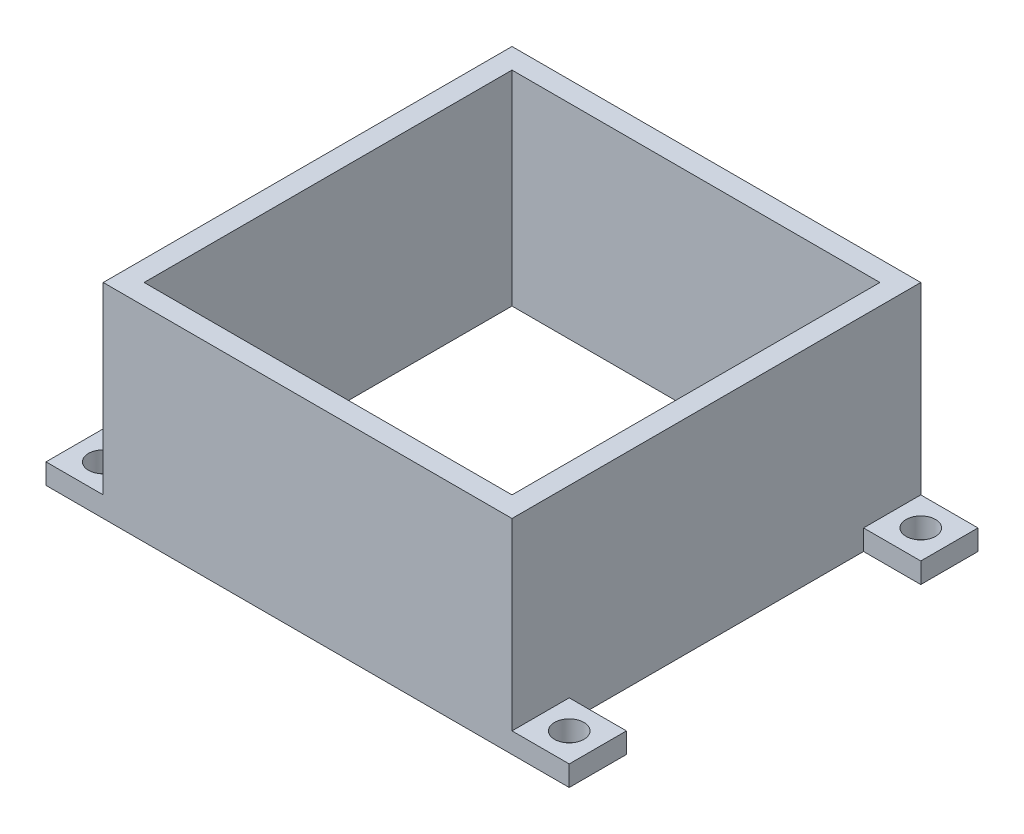
ISO-10303-21;
HEADER;
FILE_DESCRIPTION(('STEP AP214'),'2;1');
FILE_NAME('part.step','',(''),(''),'','','');
FILE_SCHEMA(('AUTOMOTIVE_DESIGN { 1 0 10303 214 1 1 1 1 }'));
ENDSEC;
DATA;
#1=APPLICATION_CONTEXT('core data for automotive mechanical design processes');
#2=APPLICATION_PROTOCOL_DEFINITION('international standard','automotive_design',2000,#1);
#3=PRODUCT_CONTEXT('',#1,'mechanical');
#4=PRODUCT('Part','Part','',(#3));
#5=PRODUCT_RELATED_PRODUCT_CATEGORY('part','',(#4));
#6=PRODUCT_DEFINITION_FORMATION('','',#4);
#7=PRODUCT_DEFINITION_CONTEXT('part definition',#1,'design');
#8=PRODUCT_DEFINITION('design','',#6,#7);
#9=PRODUCT_DEFINITION_SHAPE('','',#8);
#10=(LENGTH_UNIT() NAMED_UNIT(*) SI_UNIT(.MILLI.,.METRE.));
#11=(NAMED_UNIT(*) PLANE_ANGLE_UNIT() SI_UNIT($,.RADIAN.));
#12=(NAMED_UNIT(*) SI_UNIT($,.STERADIAN.) SOLID_ANGLE_UNIT());
#13=UNCERTAINTY_MEASURE_WITH_UNIT(LENGTH_MEASURE(1.E-05),#10,'distance_accuracy_value','');
#14=(GEOMETRIC_REPRESENTATION_CONTEXT(3) GLOBAL_UNCERTAINTY_ASSIGNED_CONTEXT((#13)) GLOBAL_UNIT_ASSIGNED_CONTEXT((#10,
#11,#12)) REPRESENTATION_CONTEXT('',''));
#15=CARTESIAN_POINT('',(0.,0.,0.));
#16=DIRECTION('',(0.,0.,1.));
#17=DIRECTION('',(1.,0.,0.));
#18=AXIS2_PLACEMENT_3D('',#15,#16,#17);
#19=CARTESIAN_POINT('',(25.,25.,-25.));
#20=DIRECTION('',(-1.,0.,0.));
#21=DIRECTION('',(0.,0.,1.));
#22=AXIS2_PLACEMENT_3D('',#19,#20,#21);
#23=PLANE('',#22);
#24=DIRECTION('',(0.,0.,-1.));
#25=VECTOR('',#24,1.);
#26=CARTESIAN_POINT('',(25.,0.,-25.));
#27=LINE('',#26,#25);
#28=CARTESIAN_POINT('',(25.,0.,18.));
#29=VERTEX_POINT('',#28);
#30=CARTESIAN_POINT('',(25.,0.,-18.));
#31=VERTEX_POINT('',#30);
#32=EDGE_CURVE('E215',#29,#31,#27,.T.);
#33=ORIENTED_EDGE('',*,*,#32,.T.);
#34=DIRECTION('',(0.,-1.,0.));
#35=VECTOR('',#34,1.);
#36=CARTESIAN_POINT('',(25.,2.5,-18.));
#37=LINE('',#36,#35);
#38=CARTESIAN_POINT('',(25.,2.5,-18.));
#39=VERTEX_POINT('',#38);
#40=EDGE_CURVE('E196',#39,#31,#37,.T.);
#41=ORIENTED_EDGE('',*,*,#40,.F.);
#42=DIRECTION('',(0.,0.,-1.));
#43=VECTOR('',#42,1.);
#44=CARTESIAN_POINT('',(25.,2.5,-25.));
#45=LINE('',#44,#43);
#46=CARTESIAN_POINT('',(25.,2.5,-25.));
#47=VERTEX_POINT('',#46);
#48=EDGE_CURVE('E180',#39,#47,#45,.T.);
#49=ORIENTED_EDGE('',*,*,#48,.T.);
#50=DIRECTION('',(0.,-1.,0.));
#51=VECTOR('',#50,1.);
#52=CARTESIAN_POINT('',(25.,25.,-25.));
#53=LINE('',#52,#51);
#54=CARTESIAN_POINT('',(25.,25.,-25.));
#55=VERTEX_POINT('',#54);
#56=EDGE_CURVE('E194',#55,#47,#53,.T.);
#57=ORIENTED_EDGE('',*,*,#56,.F.);
#58=DIRECTION('',(0.,0.,-1.));
#59=VECTOR('',#58,1.);
#60=CARTESIAN_POINT('',(25.,25.,-25.));
#61=LINE('',#60,#59);
#62=CARTESIAN_POINT('',(25.,25.,25.));
#63=VERTEX_POINT('',#62);
#64=EDGE_CURVE('E227',#63,#55,#61,.T.);
#65=ORIENTED_EDGE('',*,*,#64,.F.);
#66=DIRECTION('',(0.,-1.,0.));
#67=VECTOR('',#66,1.);
#68=CARTESIAN_POINT('',(25.,25.,25.));
#69=LINE('',#68,#67);
#70=CARTESIAN_POINT('',(25.,2.5,25.));
#71=VERTEX_POINT('',#70);
#72=EDGE_CURVE('E48',#63,#71,#69,.T.);
#73=ORIENTED_EDGE('',*,*,#72,.T.);
#74=DIRECTION('',(0.,0.,1.));
#75=VECTOR('',#74,1.);
#76=CARTESIAN_POINT('',(25.,2.5,25.));
#77=LINE('',#76,#75);
#78=CARTESIAN_POINT('',(25.,2.5,18.));
#79=VERTEX_POINT('',#78);
#80=EDGE_CURVE('E337',#79,#71,#77,.T.);
#81=ORIENTED_EDGE('',*,*,#80,.F.);
#82=DIRECTION('',(0.,-1.,0.));
#83=VECTOR('',#82,1.);
#84=CARTESIAN_POINT('',(25.,2.5,18.));
#85=LINE('',#84,#83);
#86=EDGE_CURVE('E322',#79,#29,#85,.T.);
#87=ORIENTED_EDGE('',*,*,#86,.T.);
#88=EDGE_LOOP('',(#33,#41,#49,#57,#65,#73,#81,#87));
#89=FACE_BOUND('',#88,.T.);
#90=ADVANCED_FACE('F39',(#89),#23,.F.);
#91=CARTESIAN_POINT('',(-25.,25.,-25.));
#92=DIRECTION('',(1.,0.,0.));
#93=DIRECTION('',(0.,0.,-1.));
#94=AXIS2_PLACEMENT_3D('',#91,#92,#93);
#95=PLANE('',#94);
#96=DIRECTION('',(0.,-1.,0.));
#97=VECTOR('',#96,1.);
#98=CARTESIAN_POINT('',(-25.,25.,-25.));
#99=LINE('',#98,#97);
#100=CARTESIAN_POINT('',(-25.,25.,-25.));
#101=VERTEX_POINT('',#100);
#102=CARTESIAN_POINT('',(-25.,2.5,-25.));
#103=VERTEX_POINT('',#102);
#104=EDGE_CURVE('E204',#101,#103,#99,.T.);
#105=ORIENTED_EDGE('',*,*,#104,.T.);
#106=DIRECTION('',(0.,0.,-1.));
#107=VECTOR('',#106,1.);
#108=CARTESIAN_POINT('',(-25.,2.5,-25.));
#109=LINE('',#108,#107);
#110=CARTESIAN_POINT('',(-25.,2.5,-18.));
#111=VERTEX_POINT('',#110);
#112=EDGE_CURVE('E55',#111,#103,#109,.T.);
#113=ORIENTED_EDGE('',*,*,#112,.F.);
#114=DIRECTION('',(0.,-1.,0.));
#115=VECTOR('',#114,1.);
#116=CARTESIAN_POINT('',(-25.,2.5,-18.));
#117=LINE('',#116,#115);
#118=CARTESIAN_POINT('',(-25.,0.,-18.));
#119=VERTEX_POINT('',#118);
#120=EDGE_CURVE('E60',#111,#119,#117,.T.);
#121=ORIENTED_EDGE('',*,*,#120,.T.);
#122=DIRECTION('',(0.,0.,1.));
#123=VECTOR('',#122,1.);
#124=CARTESIAN_POINT('',(-25.,0.,-25.));
#125=LINE('',#124,#123);
#126=CARTESIAN_POINT('',(-25.,0.,18.));
#127=VERTEX_POINT('',#126);
#128=EDGE_CURVE('E221',#119,#127,#125,.T.);
#129=ORIENTED_EDGE('',*,*,#128,.T.);
#130=DIRECTION('',(0.,-1.,0.));
#131=VECTOR('',#130,1.);
#132=CARTESIAN_POINT('',(-25.,2.5,18.));
#133=LINE('',#132,#131);
#134=CARTESIAN_POINT('',(-25.,2.5,18.));
#135=VERTEX_POINT('',#134);
#136=EDGE_CURVE('E267',#135,#127,#133,.T.);
#137=ORIENTED_EDGE('',*,*,#136,.F.);
#138=DIRECTION('',(0.,0.,1.));
#139=VECTOR('',#138,1.);
#140=CARTESIAN_POINT('',(-25.,2.5,25.));
#141=LINE('',#140,#139);
#142=CARTESIAN_POINT('',(-25.,2.5,25.));
#143=VERTEX_POINT('',#142);
#144=EDGE_CURVE('E294',#135,#143,#141,.T.);
#145=ORIENTED_EDGE('',*,*,#144,.T.);
#146=DIRECTION('',(0.,-1.,0.));
#147=VECTOR('',#146,1.);
#148=CARTESIAN_POINT('',(-25.,25.,25.));
#149=LINE('',#148,#147);
#150=CARTESIAN_POINT('',(-25.,25.,25.));
#151=VERTEX_POINT('',#150);
#152=EDGE_CURVE('E11',#151,#143,#149,.T.);
#153=ORIENTED_EDGE('',*,*,#152,.F.);
#154=DIRECTION('',(0.,0.,1.));
#155=VECTOR('',#154,1.);
#156=CARTESIAN_POINT('',(-25.,25.,-25.));
#157=LINE('',#156,#155);
#158=EDGE_CURVE('E214',#101,#151,#157,.T.);
#159=ORIENTED_EDGE('',*,*,#158,.F.);
#160=EDGE_LOOP('',(#105,#113,#121,#129,#137,#145,#153,#159));
#161=FACE_BOUND('',#160,.T.);
#162=ADVANCED_FACE('F41',(#161),#95,.F.);
#163=CARTESIAN_POINT('',(0.,25.,0.));
#164=DIRECTION('',(0.,1.,0.));
#165=DIRECTION('',(0.,0.,1.));
#166=AXIS2_PLACEMENT_3D('',#163,#164,#165);
#167=PLANE('',#166);
#168=ORIENTED_EDGE('',*,*,#158,.T.);
#169=DIRECTION('',(1.,0.,0.));
#170=VECTOR('',#169,1.);
#171=CARTESIAN_POINT('',(-25.,25.,25.));
#172=LINE('',#171,#170);
#173=EDGE_CURVE('E230',#151,#63,#172,.T.);
#174=ORIENTED_EDGE('',*,*,#173,.T.);
#175=ORIENTED_EDGE('',*,*,#64,.T.);
#176=DIRECTION('',(-1.,0.,0.));
#177=VECTOR('',#176,1.);
#178=CARTESIAN_POINT('',(-25.,25.,-25.));
#179=LINE('',#178,#177);
#180=EDGE_CURVE('E202',#55,#101,#179,.T.);
#181=ORIENTED_EDGE('',*,*,#180,.T.);
#182=EDGE_LOOP('',(#168,#174,#175,#181));
#183=FACE_BOUND('',#182,.T.);
#184=DIRECTION('',(1.,0.,0.));
#185=VECTOR('',#184,1.);
#186=CARTESIAN_POINT('',(-22.5,25.,22.5));
#187=LINE('',#186,#185);
#188=CARTESIAN_POINT('',(-22.5,25.,22.5));
#189=VERTEX_POINT('',#188);
#190=CARTESIAN_POINT('',(22.5,25.,22.5));
#191=VERTEX_POINT('',#190);
#192=EDGE_CURVE('E274',#189,#191,#187,.T.);
#193=ORIENTED_EDGE('',*,*,#192,.F.);
#194=DIRECTION('',(0.,0.,1.));
#195=VECTOR('',#194,1.);
#196=CARTESIAN_POINT('',(-22.5,25.,-22.5));
#197=LINE('',#196,#195);
#198=CARTESIAN_POINT('',(-22.5,25.,-22.5));
#199=VERTEX_POINT('',#198);
#200=EDGE_CURVE('E254',#199,#189,#197,.T.);
#201=ORIENTED_EDGE('',*,*,#200,.F.);
#202=DIRECTION('',(-1.,0.,0.));
#203=VECTOR('',#202,1.);
#204=CARTESIAN_POINT('',(-22.5,25.,-22.5));
#205=LINE('',#204,#203);
#206=CARTESIAN_POINT('',(22.5,25.,-22.5));
#207=VERTEX_POINT('',#206);
#208=EDGE_CURVE('E249',#207,#199,#205,.T.);
#209=ORIENTED_EDGE('',*,*,#208,.F.);
#210=DIRECTION('',(0.,0.,-1.));
#211=VECTOR('',#210,1.);
#212=CARTESIAN_POINT('',(22.5,25.,-22.5));
#213=LINE('',#212,#211);
#214=EDGE_CURVE('E270',#191,#207,#213,.T.);
#215=ORIENTED_EDGE('',*,*,#214,.F.);
#216=EDGE_LOOP('',(#193,#201,#209,#215));
#217=FACE_BOUND('',#216,.T.);
#218=ADVANCED_FACE('F435',(#183,#217),#167,.T.);
#219=CARTESIAN_POINT('',(0.,0.,0.));
#220=DIRECTION('',(0.,1.,0.));
#221=DIRECTION('',(0.,0.,1.));
#222=AXIS2_PLACEMENT_3D('',#219,#220,#221);
#223=PLANE('',#222);
#224=ORIENTED_EDGE('',*,*,#128,.F.);
#225=DIRECTION('',(1.,0.,0.));
#226=VECTOR('',#225,1.);
#227=CARTESIAN_POINT('',(-25.,0.,-18.));
#228=LINE('',#227,#226);
#229=CARTESIAN_POINT('',(-32.,0.,-18.));
#230=VERTEX_POINT('',#229);
#231=EDGE_CURVE('E374',#230,#119,#228,.T.);
#232=ORIENTED_EDGE('',*,*,#231,.F.);
#233=DIRECTION('',(0.,0.,1.));
#234=VECTOR('',#233,1.);
#235=CARTESIAN_POINT('',(-32.,0.,-25.));
#236=LINE('',#235,#234);
#237=CARTESIAN_POINT('',(-32.,0.,-25.));
#238=VERTEX_POINT('',#237);
#239=EDGE_CURVE('E371',#238,#230,#236,.T.);
#240=ORIENTED_EDGE('',*,*,#239,.F.);
#241=DIRECTION('',(-1.,0.,0.));
#242=VECTOR('',#241,1.);
#243=CARTESIAN_POINT('',(-25.,0.,-25.));
#244=LINE('',#243,#242);
#245=CARTESIAN_POINT('',(32.,0.,-25.));
#246=VERTEX_POINT('',#245);
#247=EDGE_CURVE('E211',#246,#238,#244,.T.);
#248=ORIENTED_EDGE('',*,*,#247,.F.);
#249=DIRECTION('',(0.,0.,1.));
#250=VECTOR('',#249,1.);
#251=CARTESIAN_POINT('',(32.,0.,-25.));
#252=LINE('',#251,#250);
#253=CARTESIAN_POINT('',(32.,0.,-18.));
#254=VERTEX_POINT('',#253);
#255=EDGE_CURVE('E408',#246,#254,#252,.T.);
#256=ORIENTED_EDGE('',*,*,#255,.T.);
#257=DIRECTION('',(-1.,0.,0.));
#258=VECTOR('',#257,1.);
#259=CARTESIAN_POINT('',(25.,0.,-18.));
#260=LINE('',#259,#258);
#261=EDGE_CURVE('E198',#254,#31,#260,.T.);
#262=ORIENTED_EDGE('',*,*,#261,.T.);
#263=ORIENTED_EDGE('',*,*,#32,.F.);
#264=DIRECTION('',(-1.,0.,0.));
#265=VECTOR('',#264,1.);
#266=CARTESIAN_POINT('',(25.,0.,18.));
#267=LINE('',#266,#265);
#268=CARTESIAN_POINT('',(32.,0.,18.));
#269=VERTEX_POINT('',#268);
#270=EDGE_CURVE('E338',#269,#29,#267,.T.);
#271=ORIENTED_EDGE('',*,*,#270,.F.);
#272=DIRECTION('',(0.,0.,-1.));
#273=VECTOR('',#272,1.);
#274=CARTESIAN_POINT('',(32.,0.,25.));
#275=LINE('',#274,#273);
#276=CARTESIAN_POINT('',(32.,0.,25.));
#277=VERTEX_POINT('',#276);
#278=EDGE_CURVE('E334',#277,#269,#275,.T.);
#279=ORIENTED_EDGE('',*,*,#278,.F.);
#280=DIRECTION('',(1.,0.,0.));
#281=VECTOR('',#280,1.);
#282=CARTESIAN_POINT('',(-25.,0.,25.));
#283=LINE('',#282,#281);
#284=CARTESIAN_POINT('',(-32.,0.,25.));
#285=VERTEX_POINT('',#284);
#286=EDGE_CURVE('E218',#285,#277,#283,.T.);
#287=ORIENTED_EDGE('',*,*,#286,.F.);
#288=DIRECTION('',(0.,0.,-1.));
#289=VECTOR('',#288,1.);
#290=CARTESIAN_POINT('',(-32.,0.,25.));
#291=LINE('',#290,#289);
#292=CARTESIAN_POINT('',(-32.,0.,18.));
#293=VERTEX_POINT('',#292);
#294=EDGE_CURVE('E295',#285,#293,#291,.T.);
#295=ORIENTED_EDGE('',*,*,#294,.T.);
#296=DIRECTION('',(1.,0.,0.));
#297=VECTOR('',#296,1.);
#298=CARTESIAN_POINT('',(-25.,0.,18.));
#299=LINE('',#298,#297);
#300=EDGE_CURVE('E290',#293,#127,#299,.T.);
#301=ORIENTED_EDGE('',*,*,#300,.T.);
#302=EDGE_LOOP('',(#224,#232,#240,#248,#256,#262,#263,#271,#279,#287,#295,#301));
#303=FACE_BOUND('',#302,.T.);
#304=DIRECTION('',(0.,0.,1.));
#305=VECTOR('',#304,1.);
#306=CARTESIAN_POINT('',(-22.5,0.,-22.5));
#307=LINE('',#306,#305);
#308=CARTESIAN_POINT('',(-22.5,0.,-22.5));
#309=VERTEX_POINT('',#308);
#310=CARTESIAN_POINT('',(-22.5,0.,22.5));
#311=VERTEX_POINT('',#310);
#312=EDGE_CURVE('E263',#309,#311,#307,.T.);
#313=ORIENTED_EDGE('',*,*,#312,.T.);
#314=DIRECTION('',(1.,0.,0.));
#315=VECTOR('',#314,1.);
#316=CARTESIAN_POINT('',(-22.5,0.,22.5));
#317=LINE('',#316,#315);
#318=CARTESIAN_POINT('',(22.5,0.,22.5));
#319=VERTEX_POINT('',#318);
#320=EDGE_CURVE('E259',#311,#319,#317,.T.);
#321=ORIENTED_EDGE('',*,*,#320,.T.);
#322=DIRECTION('',(0.,0.,-1.));
#323=VECTOR('',#322,1.);
#324=CARTESIAN_POINT('',(22.5,0.,-22.5));
#325=LINE('',#324,#323);
#326=CARTESIAN_POINT('',(22.5,0.,-22.5));
#327=VERTEX_POINT('',#326);
#328=EDGE_CURVE('E255',#319,#327,#325,.T.);
#329=ORIENTED_EDGE('',*,*,#328,.T.);
#330=DIRECTION('',(-1.,0.,0.));
#331=VECTOR('',#330,1.);
#332=CARTESIAN_POINT('',(-22.5,0.,-22.5));
#333=LINE('',#332,#331);
#334=EDGE_CURVE('E250',#327,#309,#333,.T.);
#335=ORIENTED_EDGE('',*,*,#334,.T.);
#336=EDGE_LOOP('',(#313,#321,#329,#335));
#337=FACE_BOUND('',#336,.T.);
#338=CARTESIAN_POINT('',(-28.5,0.,21.5));
#339=DIRECTION('',(0.,-1.,0.));
#340=DIRECTION('',(0.,0.,-1.));
#341=AXIS2_PLACEMENT_3D('',#338,#339,#340);
#342=CIRCLE('',#341,1.8);
#343=CARTESIAN_POINT('',(-28.5,0.,19.7));
#344=VERTEX_POINT('',#343);
#345=EDGE_CURVE('E314',#344,#344,#342,.T.);
#346=ORIENTED_EDGE('',*,*,#345,.F.);
#347=EDGE_LOOP('',(#346));
#348=FACE_BOUND('',#347,.T.);
#349=CARTESIAN_POINT('',(28.5,0.,21.5));
#350=DIRECTION('',(0.,1.,0.));
#351=DIRECTION('',(0.,0.,-1.));
#352=AXIS2_PLACEMENT_3D('',#349,#350,#351);
#353=CIRCLE('',#352,1.8);
#354=CARTESIAN_POINT('',(28.5,0.,19.7));
#355=VERTEX_POINT('',#354);
#356=EDGE_CURVE('E353',#355,#355,#353,.T.);
#357=ORIENTED_EDGE('',*,*,#356,.T.);
#358=EDGE_LOOP('',(#357));
#359=FACE_BOUND('',#358,.T.);
#360=CARTESIAN_POINT('',(-28.5,0.,-21.5));
#361=DIRECTION('',(0.,1.,0.));
#362=DIRECTION('',(0.,0.,1.));
#363=AXIS2_PLACEMENT_3D('',#360,#361,#362);
#364=CIRCLE('',#363,1.8);
#365=CARTESIAN_POINT('',(-28.5,0.,-19.7));
#366=VERTEX_POINT('',#365);
#367=EDGE_CURVE('E389',#366,#366,#364,.T.);
#368=ORIENTED_EDGE('',*,*,#367,.T.);
#369=EDGE_LOOP('',(#368));
#370=FACE_BOUND('',#369,.T.);
#371=CARTESIAN_POINT('',(28.5,0.,-21.5));
#372=DIRECTION('',(0.,-1.,0.));
#373=DIRECTION('',(0.,0.,1.));
#374=AXIS2_PLACEMENT_3D('',#371,#372,#373);
#375=CIRCLE('',#374,1.8);
#376=CARTESIAN_POINT('',(28.5,0.,-19.7));
#377=VERTEX_POINT('',#376);
#378=EDGE_CURVE('E417',#377,#377,#375,.T.);
#379=ORIENTED_EDGE('',*,*,#378,.F.);
#380=EDGE_LOOP('',(#379));
#381=FACE_BOUND('',#380,.T.);
#382=ADVANCED_FACE('F432',(#303,#337,#348,#359,#370,#381),#223,.F.);
#383=CARTESIAN_POINT('',(-25.,25.,25.));
#384=DIRECTION('',(0.,0.,-1.));
#385=DIRECTION('',(-1.,0.,0.));
#386=AXIS2_PLACEMENT_3D('',#383,#384,#385);
#387=PLANE('',#386);
#388=ORIENTED_EDGE('',*,*,#286,.T.);
#389=DIRECTION('',(0.,-1.,0.));
#390=VECTOR('',#389,1.);
#391=CARTESIAN_POINT('',(32.,2.5,25.));
#392=LINE('',#391,#390);
#393=CARTESIAN_POINT('',(32.,2.5,25.));
#394=VERTEX_POINT('',#393);
#395=EDGE_CURVE('E318',#394,#277,#392,.T.);
#396=ORIENTED_EDGE('',*,*,#395,.F.);
#397=DIRECTION('',(1.,0.,0.));
#398=VECTOR('',#397,1.);
#399=CARTESIAN_POINT('',(25.,2.5,25.));
#400=LINE('',#399,#398);
#401=EDGE_CURVE('E327',#71,#394,#400,.T.);
#402=ORIENTED_EDGE('',*,*,#401,.F.);
#403=ORIENTED_EDGE('',*,*,#72,.F.);
#404=ORIENTED_EDGE('',*,*,#173,.F.);
#405=ORIENTED_EDGE('',*,*,#152,.T.);
#406=DIRECTION('',(-1.,0.,0.));
#407=VECTOR('',#406,1.);
#408=CARTESIAN_POINT('',(-25.,2.5,25.));
#409=LINE('',#408,#407);
#410=CARTESIAN_POINT('',(-32.,2.5,25.));
#411=VERTEX_POINT('',#410);
#412=EDGE_CURVE('E307',#143,#411,#409,.T.);
#413=ORIENTED_EDGE('',*,*,#412,.T.);
#414=DIRECTION('',(0.,-1.,0.));
#415=VECTOR('',#414,1.);
#416=CARTESIAN_POINT('',(-32.,2.5,25.));
#417=LINE('',#416,#415);
#418=EDGE_CURVE('E279',#411,#285,#417,.T.);
#419=ORIENTED_EDGE('',*,*,#418,.T.);
#420=EDGE_LOOP('',(#388,#396,#402,#403,#404,#405,#413,#419));
#421=FACE_BOUND('',#420,.T.);
#422=ADVANCED_FACE('F434',(#421),#387,.F.);
#423=CARTESIAN_POINT('',(-25.,25.,-25.));
#424=DIRECTION('',(0.,0.,1.));
#425=DIRECTION('',(1.,0.,0.));
#426=AXIS2_PLACEMENT_3D('',#423,#424,#425);
#427=PLANE('',#426);
#428=ORIENTED_EDGE('',*,*,#247,.T.);
#429=DIRECTION('',(0.,-1.,0.));
#430=VECTOR('',#429,1.);
#431=CARTESIAN_POINT('',(-32.,2.5,-25.));
#432=LINE('',#431,#430);
#433=CARTESIAN_POINT('',(-32.,2.5,-25.));
#434=VERTEX_POINT('',#433);
#435=EDGE_CURVE('E357',#434,#238,#432,.T.);
#436=ORIENTED_EDGE('',*,*,#435,.F.);
#437=DIRECTION('',(-1.,0.,0.));
#438=VECTOR('',#437,1.);
#439=CARTESIAN_POINT('',(-25.,2.5,-25.));
#440=LINE('',#439,#438);
#441=EDGE_CURVE('E364',#103,#434,#440,.T.);
#442=ORIENTED_EDGE('',*,*,#441,.F.);
#443=ORIENTED_EDGE('',*,*,#104,.F.);
#444=ORIENTED_EDGE('',*,*,#180,.F.);
#445=ORIENTED_EDGE('',*,*,#56,.T.);
#446=DIRECTION('',(1.,0.,0.));
#447=VECTOR('',#446,1.);
#448=CARTESIAN_POINT('',(25.,2.5,-25.));
#449=LINE('',#448,#447);
#450=CARTESIAN_POINT('',(32.,2.5,-25.));
#451=VERTEX_POINT('',#450);
#452=EDGE_CURVE('E176',#47,#451,#449,.T.);
#453=ORIENTED_EDGE('',*,*,#452,.T.);
#454=DIRECTION('',(0.,-1.,0.));
#455=VECTOR('',#454,1.);
#456=CARTESIAN_POINT('',(32.,2.5,-25.));
#457=LINE('',#456,#455);
#458=EDGE_CURVE('E396',#451,#246,#457,.T.);
#459=ORIENTED_EDGE('',*,*,#458,.T.);
#460=EDGE_LOOP('',(#428,#436,#442,#443,#444,#445,#453,#459));
#461=FACE_BOUND('',#460,.T.);
#462=ADVANCED_FACE('F200',(#461),#427,.F.);
#463=CARTESIAN_POINT('',(-22.5,25.,-22.5));
#464=DIRECTION('',(1.,0.,0.));
#465=DIRECTION('',(0.,0.,-1.));
#466=AXIS2_PLACEMENT_3D('',#463,#464,#465);
#467=PLANE('',#466);
#468=ORIENTED_EDGE('',*,*,#312,.F.);
#469=DIRECTION('',(0.,-1.,0.));
#470=VECTOR('',#469,1.);
#471=CARTESIAN_POINT('',(-22.5,25.,-22.5));
#472=LINE('',#471,#470);
#473=EDGE_CURVE('E245',#199,#309,#472,.T.);
#474=ORIENTED_EDGE('',*,*,#473,.F.);
#475=ORIENTED_EDGE('',*,*,#200,.T.);
#476=DIRECTION('',(0.,-1.,0.));
#477=VECTOR('',#476,1.);
#478=CARTESIAN_POINT('',(-22.5,25.,22.5));
#479=LINE('',#478,#477);
#480=EDGE_CURVE('E224',#189,#311,#479,.T.);
#481=ORIENTED_EDGE('',*,*,#480,.T.);
#482=EDGE_LOOP('',(#468,#474,#475,#481));
#483=FACE_BOUND('',#482,.T.);
#484=ADVANCED_FACE('F453',(#483),#467,.T.);
#485=CARTESIAN_POINT('',(-22.5,25.,22.5));
#486=DIRECTION('',(0.,0.,-1.));
#487=DIRECTION('',(-1.,0.,0.));
#488=AXIS2_PLACEMENT_3D('',#485,#486,#487);
#489=PLANE('',#488);
#490=ORIENTED_EDGE('',*,*,#320,.F.);
#491=ORIENTED_EDGE('',*,*,#480,.F.);
#492=ORIENTED_EDGE('',*,*,#192,.T.);
#493=DIRECTION('',(0.,-1.,0.));
#494=VECTOR('',#493,1.);
#495=CARTESIAN_POINT('',(22.5,25.,22.5));
#496=LINE('',#495,#494);
#497=EDGE_CURVE('E239',#191,#319,#496,.T.);
#498=ORIENTED_EDGE('',*,*,#497,.T.);
#499=EDGE_LOOP('',(#490,#491,#492,#498));
#500=FACE_BOUND('',#499,.T.);
#501=ADVANCED_FACE('F457',(#500),#489,.T.);
#502=CARTESIAN_POINT('',(22.5,25.,-22.5));
#503=DIRECTION('',(-1.,0.,0.));
#504=DIRECTION('',(0.,0.,1.));
#505=AXIS2_PLACEMENT_3D('',#502,#503,#504);
#506=PLANE('',#505);
#507=ORIENTED_EDGE('',*,*,#328,.F.);
#508=ORIENTED_EDGE('',*,*,#497,.F.);
#509=ORIENTED_EDGE('',*,*,#214,.T.);
#510=DIRECTION('',(0.,-1.,0.));
#511=VECTOR('',#510,1.);
#512=CARTESIAN_POINT('',(22.5,25.,-22.5));
#513=LINE('',#512,#511);
#514=EDGE_CURVE('E242',#207,#327,#513,.T.);
#515=ORIENTED_EDGE('',*,*,#514,.T.);
#516=EDGE_LOOP('',(#507,#508,#509,#515));
#517=FACE_BOUND('',#516,.T.);
#518=ADVANCED_FACE('F463',(#517),#506,.T.);
#519=CARTESIAN_POINT('',(-22.5,25.,-22.5));
#520=DIRECTION('',(0.,0.,1.));
#521=DIRECTION('',(1.,0.,0.));
#522=AXIS2_PLACEMENT_3D('',#519,#520,#521);
#523=PLANE('',#522);
#524=ORIENTED_EDGE('',*,*,#334,.F.);
#525=ORIENTED_EDGE('',*,*,#514,.F.);
#526=ORIENTED_EDGE('',*,*,#208,.T.);
#527=ORIENTED_EDGE('',*,*,#473,.T.);
#528=EDGE_LOOP('',(#524,#525,#526,#527));
#529=FACE_BOUND('',#528,.T.);
#530=ADVANCED_FACE('F469',(#529),#523,.T.);
#531=CARTESIAN_POINT('',(-25.,2.5,18.));
#532=DIRECTION('',(0.,0.,-1.));
#533=DIRECTION('',(-1.,0.,0.));
#534=AXIS2_PLACEMENT_3D('',#531,#532,#533);
#535=PLANE('',#534);
#536=ORIENTED_EDGE('',*,*,#300,.F.);
#537=DIRECTION('',(0.,-1.,0.));
#538=VECTOR('',#537,1.);
#539=CARTESIAN_POINT('',(-32.,2.5,18.));
#540=LINE('',#539,#538);
#541=CARTESIAN_POINT('',(-32.,2.5,18.));
#542=VERTEX_POINT('',#541);
#543=EDGE_CURVE('E283',#542,#293,#540,.T.);
#544=ORIENTED_EDGE('',*,*,#543,.F.);
#545=DIRECTION('',(1.,0.,0.));
#546=VECTOR('',#545,1.);
#547=CARTESIAN_POINT('',(-25.,2.5,18.));
#548=LINE('',#547,#546);
#549=EDGE_CURVE('E284',#542,#135,#548,.T.);
#550=ORIENTED_EDGE('',*,*,#549,.T.);
#551=ORIENTED_EDGE('',*,*,#136,.T.);
#552=EDGE_LOOP('',(#536,#544,#550,#551));
#553=FACE_BOUND('',#552,.T.);
#554=ADVANCED_FACE('F473',(#553),#535,.T.);
#555=CARTESIAN_POINT('',(-32.,2.5,25.));
#556=DIRECTION('',(-1.,0.,0.));
#557=DIRECTION('',(0.,0.,1.));
#558=AXIS2_PLACEMENT_3D('',#555,#556,#557);
#559=PLANE('',#558);
#560=ORIENTED_EDGE('',*,*,#294,.F.);
#561=ORIENTED_EDGE('',*,*,#418,.F.);
#562=DIRECTION('',(0.,0.,-1.));
#563=VECTOR('',#562,1.);
#564=CARTESIAN_POINT('',(-32.,2.5,25.));
#565=LINE('',#564,#563);
#566=EDGE_CURVE('E303',#411,#542,#565,.T.);
#567=ORIENTED_EDGE('',*,*,#566,.T.);
#568=ORIENTED_EDGE('',*,*,#543,.T.);
#569=EDGE_LOOP('',(#560,#561,#567,#568));
#570=FACE_BOUND('',#569,.T.);
#571=ADVANCED_FACE('F475',(#570),#559,.T.);
#572=CARTESIAN_POINT('',(0.,2.5,0.));
#573=DIRECTION('',(0.,1.,0.));
#574=DIRECTION('',(0.,0.,1.));
#575=AXIS2_PLACEMENT_3D('',#572,#573,#574);
#576=PLANE('',#575);
#577=CARTESIAN_POINT('',(-28.5,2.5,21.5));
#578=DIRECTION('',(0.,-1.,0.));
#579=DIRECTION('',(0.,0.,-1.));
#580=AXIS2_PLACEMENT_3D('',#577,#578,#579);
#581=CIRCLE('',#580,1.8);
#582=CARTESIAN_POINT('',(-28.5,2.5,19.7));
#583=VERTEX_POINT('',#582);
#584=EDGE_CURVE('E299',#583,#583,#581,.T.);
#585=ORIENTED_EDGE('',*,*,#584,.T.);
#586=EDGE_LOOP('',(#585));
#587=FACE_BOUND('',#586,.T.);
#588=ORIENTED_EDGE('',*,*,#144,.F.);
#589=ORIENTED_EDGE('',*,*,#549,.F.);
#590=ORIENTED_EDGE('',*,*,#566,.F.);
#591=ORIENTED_EDGE('',*,*,#412,.F.);
#592=EDGE_LOOP('',(#588,#589,#590,#591));
#593=FACE_BOUND('',#592,.T.);
#594=ADVANCED_FACE('F478',(#587,#593),#576,.T.);
#595=CARTESIAN_POINT('',(-28.5,2.5,21.5));
#596=DIRECTION('',(0.,-1.,0.));
#597=DIRECTION('',(0.,0.,-1.));
#598=AXIS2_PLACEMENT_3D('',#595,#596,#597);
#599=CYLINDRICAL_SURFACE('',#598,1.8);
#600=ORIENTED_EDGE('',*,*,#584,.F.);
#601=EDGE_LOOP('',(#600));
#602=FACE_BOUND('',#601,.T.);
#603=ORIENTED_EDGE('',*,*,#345,.T.);
#604=EDGE_LOOP('',(#603));
#605=FACE_BOUND('',#604,.T.);
#606=ADVANCED_FACE('F485',(#602,#605),#599,.F.);
#607=CARTESIAN_POINT('',(0.,2.5,0.));
#608=DIRECTION('',(0.,1.,0.));
#609=DIRECTION('',(0.,0.,1.));
#610=AXIS2_PLACEMENT_3D('',#607,#608,#609);
#611=PLANE('',#610);
#612=ORIENTED_EDGE('',*,*,#80,.T.);
#613=ORIENTED_EDGE('',*,*,#401,.T.);
#614=DIRECTION('',(0.,0.,-1.));
#615=VECTOR('',#614,1.);
#616=CARTESIAN_POINT('',(32.,2.5,25.));
#617=LINE('',#616,#615);
#618=CARTESIAN_POINT('',(32.,2.5,18.));
#619=VERTEX_POINT('',#618);
#620=EDGE_CURVE('E344',#394,#619,#617,.T.);
#621=ORIENTED_EDGE('',*,*,#620,.T.);
#622=DIRECTION('',(-1.,0.,0.));
#623=VECTOR('',#622,1.);
#624=CARTESIAN_POINT('',(25.,2.5,18.));
#625=LINE('',#624,#623);
#626=EDGE_CURVE('E347',#619,#79,#625,.T.);
#627=ORIENTED_EDGE('',*,*,#626,.T.);
#628=EDGE_LOOP('',(#612,#613,#621,#627));
#629=FACE_BOUND('',#628,.T.);
#630=CARTESIAN_POINT('',(28.5,2.5,21.5));
#631=DIRECTION('',(0.,1.,0.));
#632=DIRECTION('',(0.,0.,-1.));
#633=AXIS2_PLACEMENT_3D('',#630,#631,#632);
#634=CIRCLE('',#633,1.8);
#635=CARTESIAN_POINT('',(28.5,2.5,19.7));
#636=VERTEX_POINT('',#635);
#637=EDGE_CURVE('E341',#636,#636,#634,.T.);
#638=ORIENTED_EDGE('',*,*,#637,.F.);
#639=EDGE_LOOP('',(#638));
#640=FACE_BOUND('',#639,.T.);
#641=ADVANCED_FACE('F489',(#629,#640),#611,.T.);
#642=CARTESIAN_POINT('',(32.,2.5,25.));
#643=DIRECTION('',(-1.,0.,0.));
#644=DIRECTION('',(0.,0.,1.));
#645=AXIS2_PLACEMENT_3D('',#642,#643,#644);
#646=PLANE('',#645);
#647=ORIENTED_EDGE('',*,*,#278,.T.);
#648=DIRECTION('',(0.,-1.,0.));
#649=VECTOR('',#648,1.);
#650=CARTESIAN_POINT('',(32.,2.5,18.));
#651=LINE('',#650,#649);
#652=EDGE_CURVE('E326',#619,#269,#651,.T.);
#653=ORIENTED_EDGE('',*,*,#652,.F.);
#654=ORIENTED_EDGE('',*,*,#620,.F.);
#655=ORIENTED_EDGE('',*,*,#395,.T.);
#656=EDGE_LOOP('',(#647,#653,#654,#655));
#657=FACE_BOUND('',#656,.T.);
#658=ADVANCED_FACE('F495',(#657),#646,.F.);
#659=CARTESIAN_POINT('',(25.,2.5,18.));
#660=DIRECTION('',(0.,0.,1.));
#661=DIRECTION('',(1.,0.,0.));
#662=AXIS2_PLACEMENT_3D('',#659,#660,#661);
#663=PLANE('',#662);
#664=ORIENTED_EDGE('',*,*,#270,.T.);
#665=ORIENTED_EDGE('',*,*,#86,.F.);
#666=ORIENTED_EDGE('',*,*,#626,.F.);
#667=ORIENTED_EDGE('',*,*,#652,.T.);
#668=EDGE_LOOP('',(#664,#665,#666,#667));
#669=FACE_BOUND('',#668,.T.);
#670=ADVANCED_FACE('F491',(#669),#663,.F.);
#671=CARTESIAN_POINT('',(28.5,2.5,21.5));
#672=DIRECTION('',(0.,-1.,0.));
#673=DIRECTION('',(0.,0.,-1.));
#674=AXIS2_PLACEMENT_3D('',#671,#672,#673);
#675=CYLINDRICAL_SURFACE('',#674,1.8);
#676=ORIENTED_EDGE('',*,*,#637,.T.);
#677=EDGE_LOOP('',(#676));
#678=FACE_BOUND('',#677,.T.);
#679=ORIENTED_EDGE('',*,*,#356,.F.);
#680=EDGE_LOOP('',(#679));
#681=FACE_BOUND('',#680,.T.);
#682=ADVANCED_FACE('F494',(#678,#681),#675,.F.);
#683=CARTESIAN_POINT('',(0.,2.5,0.));
#684=DIRECTION('',(0.,1.,0.));
#685=DIRECTION('',(0.,0.,-1.));
#686=AXIS2_PLACEMENT_3D('',#683,#684,#685);
#687=PLANE('',#686);
#688=ORIENTED_EDGE('',*,*,#112,.T.);
#689=ORIENTED_EDGE('',*,*,#441,.T.);
#690=DIRECTION('',(0.,0.,1.));
#691=VECTOR('',#690,1.);
#692=CARTESIAN_POINT('',(-32.,2.5,-25.));
#693=LINE('',#692,#691);
#694=CARTESIAN_POINT('',(-32.,2.5,-18.));
#695=VERTEX_POINT('',#694);
#696=EDGE_CURVE('E381',#434,#695,#693,.T.);
#697=ORIENTED_EDGE('',*,*,#696,.T.);
#698=DIRECTION('',(1.,0.,0.));
#699=VECTOR('',#698,1.);
#700=CARTESIAN_POINT('',(-25.,2.5,-18.));
#701=LINE('',#700,#699);
#702=EDGE_CURVE('E384',#695,#111,#701,.T.);
#703=ORIENTED_EDGE('',*,*,#702,.T.);
#704=EDGE_LOOP('',(#688,#689,#697,#703));
#705=FACE_BOUND('',#704,.T.);
#706=CARTESIAN_POINT('',(-28.5,2.5,-21.5));
#707=DIRECTION('',(0.,1.,0.));
#708=DIRECTION('',(0.,0.,1.));
#709=AXIS2_PLACEMENT_3D('',#706,#707,#708);
#710=CIRCLE('',#709,1.8);
#711=CARTESIAN_POINT('',(-28.5,2.5,-19.7));
#712=VERTEX_POINT('',#711);
#713=EDGE_CURVE('E378',#712,#712,#710,.T.);
#714=ORIENTED_EDGE('',*,*,#713,.F.);
#715=EDGE_LOOP('',(#714));
#716=FACE_BOUND('',#715,.T.);
#717=ADVANCED_FACE('F505',(#705,#716),#687,.T.);
#718=CARTESIAN_POINT('',(-32.,2.5,-25.));
#719=DIRECTION('',(1.,0.,0.));
#720=DIRECTION('',(0.,0.,-1.));
#721=AXIS2_PLACEMENT_3D('',#718,#719,#720);
#722=PLANE('',#721);
#723=ORIENTED_EDGE('',*,*,#239,.T.);
#724=DIRECTION('',(0.,-1.,0.));
#725=VECTOR('',#724,1.);
#726=CARTESIAN_POINT('',(-32.,2.5,-18.));
#727=LINE('',#726,#725);
#728=EDGE_CURVE('E363',#695,#230,#727,.T.);
#729=ORIENTED_EDGE('',*,*,#728,.F.);
#730=ORIENTED_EDGE('',*,*,#696,.F.);
#731=ORIENTED_EDGE('',*,*,#435,.T.);
#732=EDGE_LOOP('',(#723,#729,#730,#731));
#733=FACE_BOUND('',#732,.T.);
#734=ADVANCED_FACE('F511',(#733),#722,.F.);
#735=CARTESIAN_POINT('',(-25.,2.5,-18.));
#736=DIRECTION('',(0.,0.,-1.));
#737=DIRECTION('',(-1.,0.,0.));
#738=AXIS2_PLACEMENT_3D('',#735,#736,#737);
#739=PLANE('',#738);
#740=ORIENTED_EDGE('',*,*,#231,.T.);
#741=ORIENTED_EDGE('',*,*,#120,.F.);
#742=ORIENTED_EDGE('',*,*,#702,.F.);
#743=ORIENTED_EDGE('',*,*,#728,.T.);
#744=EDGE_LOOP('',(#740,#741,#742,#743));
#745=FACE_BOUND('',#744,.T.);
#746=ADVANCED_FACE('F507',(#745),#739,.F.);
#747=CARTESIAN_POINT('',(-28.5,2.5,-21.5));
#748=DIRECTION('',(0.,-1.,0.));
#749=DIRECTION('',(0.,0.,-1.));
#750=AXIS2_PLACEMENT_3D('',#747,#748,#749);
#751=CYLINDRICAL_SURFACE('',#750,1.8);
#752=ORIENTED_EDGE('',*,*,#713,.T.);
#753=EDGE_LOOP('',(#752));
#754=FACE_BOUND('',#753,.T.);
#755=ORIENTED_EDGE('',*,*,#367,.F.);
#756=EDGE_LOOP('',(#755));
#757=FACE_BOUND('',#756,.T.);
#758=ADVANCED_FACE('F510',(#754,#757),#751,.F.);
#759=CARTESIAN_POINT('',(25.,2.5,-18.));
#760=DIRECTION('',(0.,0.,1.));
#761=DIRECTION('',(1.,0.,0.));
#762=AXIS2_PLACEMENT_3D('',#759,#760,#761);
#763=PLANE('',#762);
#764=ORIENTED_EDGE('',*,*,#261,.F.);
#765=DIRECTION('',(0.,-1.,0.));
#766=VECTOR('',#765,1.);
#767=CARTESIAN_POINT('',(32.,2.5,-18.));
#768=LINE('',#767,#766);
#769=CARTESIAN_POINT('',(32.,2.5,-18.));
#770=VERTEX_POINT('',#769);
#771=EDGE_CURVE('E399',#770,#254,#768,.T.);
#772=ORIENTED_EDGE('',*,*,#771,.F.);
#773=DIRECTION('',(-1.,0.,0.));
#774=VECTOR('',#773,1.);
#775=CARTESIAN_POINT('',(25.,2.5,-18.));
#776=LINE('',#775,#774);
#777=EDGE_CURVE('E400',#770,#39,#776,.T.);
#778=ORIENTED_EDGE('',*,*,#777,.T.);
#779=ORIENTED_EDGE('',*,*,#40,.T.);
#780=EDGE_LOOP('',(#764,#772,#778,#779));
#781=FACE_BOUND('',#780,.T.);
#782=ADVANCED_FACE('F521',(#781),#763,.T.);
#783=CARTESIAN_POINT('',(32.,2.5,-25.));
#784=DIRECTION('',(1.,0.,0.));
#785=DIRECTION('',(0.,0.,-1.));
#786=AXIS2_PLACEMENT_3D('',#783,#784,#785);
#787=PLANE('',#786);
#788=ORIENTED_EDGE('',*,*,#255,.F.);
#789=ORIENTED_EDGE('',*,*,#458,.F.);
#790=DIRECTION('',(0.,0.,1.));
#791=VECTOR('',#790,1.);
#792=CARTESIAN_POINT('',(32.,2.5,-25.));
#793=LINE('',#792,#791);
#794=EDGE_CURVE('E183',#451,#770,#793,.T.);
#795=ORIENTED_EDGE('',*,*,#794,.T.);
#796=ORIENTED_EDGE('',*,*,#771,.T.);
#797=EDGE_LOOP('',(#788,#789,#795,#796));
#798=FACE_BOUND('',#797,.T.);
#799=ADVANCED_FACE('F523',(#798),#787,.T.);
#800=CARTESIAN_POINT('',(0.,2.5,0.));
#801=DIRECTION('',(0.,1.,0.));
#802=DIRECTION('',(0.,0.,-1.));
#803=AXIS2_PLACEMENT_3D('',#800,#801,#802);
#804=PLANE('',#803);
#805=CARTESIAN_POINT('',(28.5,2.5,-21.5));
#806=DIRECTION('',(0.,-1.,0.));
#807=DIRECTION('',(0.,0.,1.));
#808=AXIS2_PLACEMENT_3D('',#805,#806,#807);
#809=CIRCLE('',#808,1.8);
#810=CARTESIAN_POINT('',(28.5,2.5,-19.7));
#811=VERTEX_POINT('',#810);
#812=EDGE_CURVE('E412',#811,#811,#809,.T.);
#813=ORIENTED_EDGE('',*,*,#812,.T.);
#814=EDGE_LOOP('',(#813));
#815=FACE_BOUND('',#814,.T.);
#816=ORIENTED_EDGE('',*,*,#48,.F.);
#817=ORIENTED_EDGE('',*,*,#777,.F.);
#818=ORIENTED_EDGE('',*,*,#794,.F.);
#819=ORIENTED_EDGE('',*,*,#452,.F.);
#820=EDGE_LOOP('',(#816,#817,#818,#819));
#821=FACE_BOUND('',#820,.T.);
#822=ADVANCED_FACE('F178',(#815,#821),#804,.T.);
#823=CARTESIAN_POINT('',(28.5,2.5,-21.5));
#824=DIRECTION('',(0.,-1.,0.));
#825=DIRECTION('',(0.,0.,-1.));
#826=AXIS2_PLACEMENT_3D('',#823,#824,#825);
#827=CYLINDRICAL_SURFACE('',#826,1.8);
#828=ORIENTED_EDGE('',*,*,#812,.F.);
#829=EDGE_LOOP('',(#828));
#830=FACE_BOUND('',#829,.T.);
#831=ORIENTED_EDGE('',*,*,#378,.T.);
#832=EDGE_LOOP('',(#831));
#833=FACE_BOUND('',#832,.T.);
#834=ADVANCED_FACE('F426',(#830,#833),#827,.F.);
#835=CLOSED_SHELL('',(#90,#162,#218,#382,#422,#462,#484,#501,#518,#530,#554,#571,#594,#606,#641,
#658,#670,#682,#717,#734,#746,#758,#782,#799,#822,#834));
#836=MANIFOLD_SOLID_BREP('B2',#835);
#837=ADVANCED_BREP_SHAPE_REPRESENTATION('',(#18,#836),#14);
#838=SHAPE_DEFINITION_REPRESENTATION(#9,#837);
ENDSEC;
END-ISO-10303-21;
